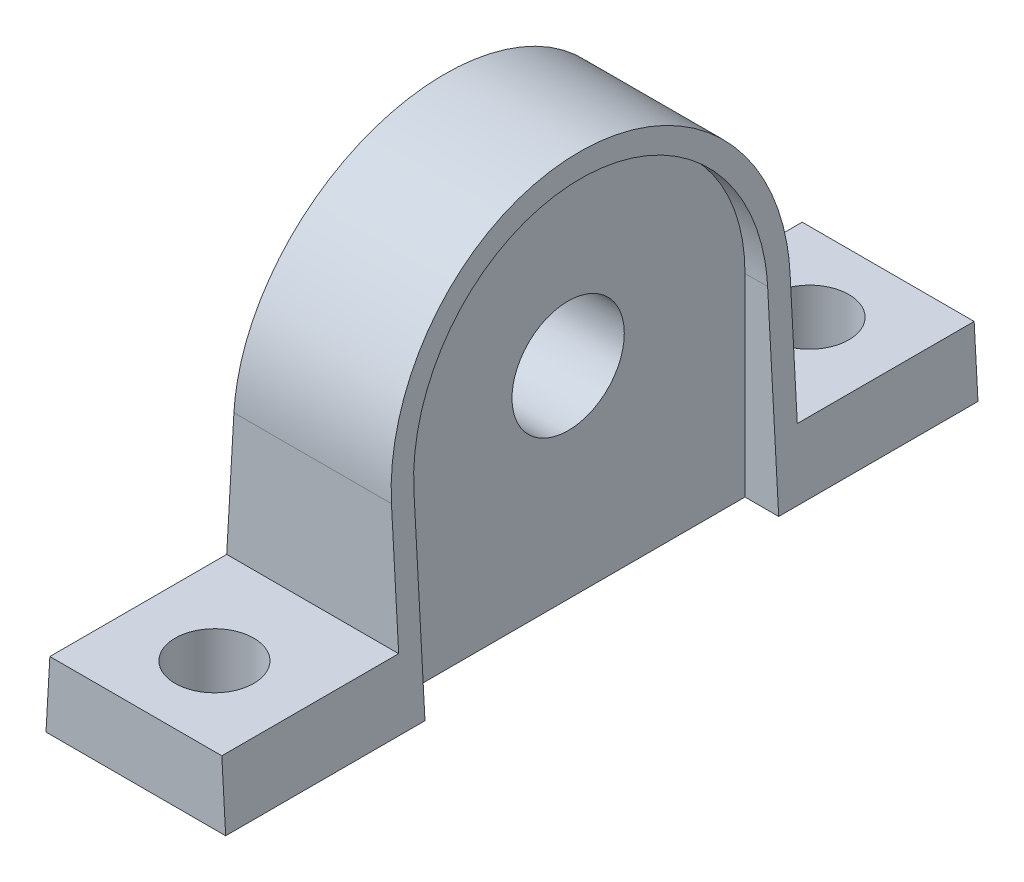
ISO-10303-21;
HEADER;
FILE_DESCRIPTION(('STEP AP214'),'2;1');
FILE_NAME('part.step','',(''),(''),'','','');
FILE_SCHEMA(('AUTOMOTIVE_DESIGN { 1 0 10303 214 1 1 1 1 }'));
ENDSEC;
DATA;
#1=APPLICATION_CONTEXT('core data for automotive mechanical design processes');
#2=APPLICATION_PROTOCOL_DEFINITION('international standard','automotive_design',2000,#1);
#3=PRODUCT_CONTEXT('',#1,'mechanical');
#4=PRODUCT('Part','Part','',(#3));
#5=PRODUCT_RELATED_PRODUCT_CATEGORY('part','',(#4));
#6=PRODUCT_DEFINITION_FORMATION('','',#4);
#7=PRODUCT_DEFINITION_CONTEXT('part definition',#1,'design');
#8=PRODUCT_DEFINITION('design','',#6,#7);
#9=PRODUCT_DEFINITION_SHAPE('','',#8);
#10=(LENGTH_UNIT() NAMED_UNIT(*) SI_UNIT(.MILLI.,.METRE.));
#11=(NAMED_UNIT(*) PLANE_ANGLE_UNIT() SI_UNIT($,.RADIAN.));
#12=(NAMED_UNIT(*) SI_UNIT($,.STERADIAN.) SOLID_ANGLE_UNIT());
#13=UNCERTAINTY_MEASURE_WITH_UNIT(LENGTH_MEASURE(1.E-05),#10,'distance_accuracy_value','');
#14=(GEOMETRIC_REPRESENTATION_CONTEXT(3) GLOBAL_UNCERTAINTY_ASSIGNED_CONTEXT((#13)) GLOBAL_UNIT_ASSIGNED_CONTEXT((#10,
#11,#12)) REPRESENTATION_CONTEXT('',''));
#15=CARTESIAN_POINT('',(0.,0.,0.));
#16=DIRECTION('',(0.,0.,1.));
#17=DIRECTION('',(1.,0.,0.));
#18=AXIS2_PLACEMENT_3D('',#15,#16,#17);
#19=CARTESIAN_POINT('',(-5.,0.,0.));
#20=DIRECTION('',(-1.,0.,0.));
#21=DIRECTION('',(0.,0.,-1.));
#22=AXIS2_PLACEMENT_3D('',#19,#20,#21);
#23=PLANE('',#22);
#24=DIRECTION('',(0.,-1.,0.));
#25=VECTOR('',#24,1.);
#26=CARTESIAN_POINT('',(-5.,0.,17.75));
#27=LINE('',#26,#25);
#28=CARTESIAN_POINT('',(-5.,17.25,17.75));
#29=VERTEX_POINT('',#28);
#30=CARTESIAN_POINT('',(-5.,0.,17.75));
#31=VERTEX_POINT('',#30);
#32=EDGE_CURVE('E191',#29,#31,#27,.T.);
#33=ORIENTED_EDGE('',*,*,#32,.T.);
#34=DIRECTION('',(0.,0.,-1.));
#35=VECTOR('',#34,1.);
#36=CARTESIAN_POINT('',(-5.,0.,0.));
#37=LINE('',#36,#35);
#38=CARTESIAN_POINT('',(-5.,0.,49.25));
#39=VERTEX_POINT('',#38);
#40=EDGE_CURVE('E202',#39,#31,#37,.T.);
#41=ORIENTED_EDGE('',*,*,#40,.F.);
#42=DIRECTION('',(0.,-1.,0.));
#43=VECTOR('',#42,1.);
#44=CARTESIAN_POINT('',(-5.,0.,49.25));
#45=LINE('',#44,#43);
#46=CARTESIAN_POINT('',(-5.,17.25,49.25));
#47=VERTEX_POINT('',#46);
#48=EDGE_CURVE('E207',#47,#39,#45,.T.);
#49=ORIENTED_EDGE('',*,*,#48,.F.);
#50=CARTESIAN_POINT('',(-5.,17.25,33.5));
#51=DIRECTION('',(1.,0.,0.));
#52=DIRECTION('',(0.,0.,-1.));
#53=AXIS2_PLACEMENT_3D('',#50,#51,#52);
#54=CIRCLE('',#53,15.75);
#55=EDGE_CURVE('E195',#29,#47,#54,.T.);
#56=ORIENTED_EDGE('',*,*,#55,.F.);
#57=EDGE_LOOP('',(#33,#41,#49,#56));
#58=FACE_BOUND('',#57,.T.);
#59=CARTESIAN_POINT('',(-5.,18.,33.5));
#60=DIRECTION('',(-1.,0.,0.));
#61=DIRECTION('',(0.,0.,1.));
#62=AXIS2_PLACEMENT_3D('',#59,#60,#61);
#63=CIRCLE('',#62,7.);
#64=CARTESIAN_POINT('',(-5.,18.,40.5));
#65=VERTEX_POINT('',#64);
#66=EDGE_CURVE('E323',#65,#65,#63,.T.);
#67=ORIENTED_EDGE('',*,*,#66,.F.);
#68=EDGE_LOOP('',(#67));
#69=FACE_BOUND('',#68,.T.);
#70=ADVANCED_FACE('F70',(#58,#69),#23,.T.);
#71=CARTESIAN_POINT('',(-15.,18.,33.5));
#72=DIRECTION('',(1.,0.,0.));
#73=DIRECTION('',(0.,0.,-1.));
#74=AXIS2_PLACEMENT_3D('',#71,#72,#73);
#75=CYLINDRICAL_SURFACE('',#74,5.);
#76=CARTESIAN_POINT('',(5.,18.,33.5));
#77=DIRECTION('',(1.,0.,0.));
#78=DIRECTION('',(0.,0.,-1.));
#79=AXIS2_PLACEMENT_3D('',#76,#77,#78);
#80=CIRCLE('',#79,5.);
#81=CARTESIAN_POINT('',(5.,18.,28.5));
#82=VERTEX_POINT('',#81);
#83=EDGE_CURVE('E229',#82,#82,#80,.F.);
#84=ORIENTED_EDGE('',*,*,#83,.F.);
#85=EDGE_LOOP('',(#84));
#86=FACE_BOUND('',#85,.T.);
#87=CARTESIAN_POINT('',(-10.,18.,33.5));
#88=DIRECTION('',(1.,0.,0.));
#89=DIRECTION('',(0.,0.,-1.));
#90=AXIS2_PLACEMENT_3D('',#87,#88,#89);
#91=CIRCLE('',#90,5.);
#92=CARTESIAN_POINT('',(-10.,18.,28.5));
#93=VERTEX_POINT('',#92);
#94=EDGE_CURVE('E318',#93,#93,#91,.T.);
#95=ORIENTED_EDGE('',*,*,#94,.F.);
#96=EDGE_LOOP('',(#95));
#97=FACE_BOUND('',#96,.T.);
#98=ADVANCED_FACE('F340',(#86,#97),#75,.F.);
#99=CARTESIAN_POINT('',(8.,0.,67.));
#100=DIRECTION('',(-0.998371334423977,-0.0570497905385129,0.));
#101=DIRECTION('',(0.0570497905385129,-0.998371334423977,0.));
#102=AXIS2_PLACEMENT_3D('',#99,#100,#101);
#103=PLANE('',#102);
#104=DIRECTION('',(-0.0570497905385129,0.998371334423977,0.));
#105=VECTOR('',#104,1.);
#106=CARTESIAN_POINT('',(8.,0.,17.75));
#107=LINE('',#106,#105);
#108=CARTESIAN_POINT('',(8.,0.,17.75));
#109=VERTEX_POINT('',#108);
#110=CARTESIAN_POINT('',(7.01428571428572,17.25,17.75));
#111=VERTEX_POINT('',#110);
#112=EDGE_CURVE('E241',#109,#111,#107,.T.);
#113=ORIENTED_EDGE('',*,*,#112,.F.);
#114=DIRECTION('',(0.,0.,-1.));
#115=VECTOR('',#114,1.);
#116=CARTESIAN_POINT('',(8.,0.,67.));
#117=LINE('',#116,#115);
#118=CARTESIAN_POINT('',(8.,0.,0.));
#119=VERTEX_POINT('',#118);
#120=EDGE_CURVE('E281',#109,#119,#117,.T.);
#121=ORIENTED_EDGE('',*,*,#120,.T.);
#122=DIRECTION('',(-0.0570497905385129,0.998371334423977,0.));
#123=VECTOR('',#122,1.);
#124=CARTESIAN_POINT('',(8.,0.,0.));
#125=LINE('',#124,#123);
#126=CARTESIAN_POINT('',(7.65714285714286,6.,0.));
#127=VERTEX_POINT('',#126);
#128=EDGE_CURVE('E272',#119,#127,#125,.T.);
#129=ORIENTED_EDGE('',*,*,#128,.T.);
#130=DIRECTION('',(0.,0.,-1.));
#131=VECTOR('',#130,1.);
#132=CARTESIAN_POINT('',(7.65714285714286,6.,67.));
#133=LINE('',#132,#131);
#134=CARTESIAN_POINT('',(7.65714285714286,6.,15.75));
#135=VERTEX_POINT('',#134);
#136=EDGE_CURVE('E266',#135,#127,#133,.T.);
#137=ORIENTED_EDGE('',*,*,#136,.F.);
#138=DIRECTION('',(0.0570497905385129,-0.998371334423977,0.));
#139=VECTOR('',#138,1.);
#140=CARTESIAN_POINT('',(8.,0.,15.75));
#141=LINE('',#140,#139);
#142=CARTESIAN_POINT('',(7.01428571428572,17.25,15.75));
#143=VERTEX_POINT('',#142);
#144=EDGE_CURVE('E270',#143,#135,#141,.T.);
#145=ORIENTED_EDGE('',*,*,#144,.F.);
#146=CARTESIAN_POINT('',(7.01428571428572,17.25,33.5));
#147=DIRECTION('',(-0.998371334423977,-0.0570497905385129,0.));
#148=DIRECTION('',(0.057049790538513,-0.998371334423977,0.));
#149=AXIS2_PLACEMENT_3D('',#146,#147,#148);
#150=ELLIPSE('',#149,17.7789559735718,17.75);
#151=CARTESIAN_POINT('',(7.01428571428572,17.25,51.25));
#152=VERTEX_POINT('',#151);
#153=EDGE_CURVE('E268',#143,#152,#150,.F.);
#154=ORIENTED_EDGE('',*,*,#153,.T.);
#155=DIRECTION('',(0.0570497905385129,-0.998371334423977,0.));
#156=VECTOR('',#155,1.);
#157=CARTESIAN_POINT('',(8.,0.,51.25));
#158=LINE('',#157,#156);
#159=CARTESIAN_POINT('',(7.65714285714286,6.,51.25));
#160=VERTEX_POINT('',#159);
#161=EDGE_CURVE('E255',#152,#160,#158,.T.);
#162=ORIENTED_EDGE('',*,*,#161,.T.);
#163=DIRECTION('',(0.,0.,1.));
#164=VECTOR('',#163,1.);
#165=CARTESIAN_POINT('',(7.65714285714286,6.,67.));
#166=LINE('',#165,#164);
#167=CARTESIAN_POINT('',(7.65714285714286,6.,67.));
#168=VERTEX_POINT('',#167);
#169=EDGE_CURVE('E252',#160,#168,#166,.T.);
#170=ORIENTED_EDGE('',*,*,#169,.T.);
#171=DIRECTION('',(-0.0570497905385129,0.998371334423977,0.));
#172=VECTOR('',#171,1.);
#173=CARTESIAN_POINT('',(8.,0.,67.));
#174=LINE('',#173,#172);
#175=CARTESIAN_POINT('',(8.,0.,67.));
#176=VERTEX_POINT('',#175);
#177=EDGE_CURVE('E273',#176,#168,#174,.T.);
#178=ORIENTED_EDGE('',*,*,#177,.F.);
#179=CARTESIAN_POINT('',(8.,0.,49.25));
#180=VERTEX_POINT('',#179);
#181=EDGE_CURVE('E289',#176,#180,#117,.T.);
#182=ORIENTED_EDGE('',*,*,#181,.T.);
#183=DIRECTION('',(-0.0570497905385129,0.998371334423977,0.));
#184=VECTOR('',#183,1.);
#185=CARTESIAN_POINT('',(8.,0.,49.25));
#186=LINE('',#185,#184);
#187=CARTESIAN_POINT('',(7.01428571428572,17.25,49.25));
#188=VERTEX_POINT('',#187);
#189=EDGE_CURVE('E238',#180,#188,#186,.T.);
#190=ORIENTED_EDGE('',*,*,#189,.T.);
#191=CARTESIAN_POINT('',(7.01428571428572,17.25,33.5));
#192=DIRECTION('',(-0.998371334423977,-0.0570497905385129,0.));
#193=DIRECTION('',(0.057049790538513,-0.998371334423977,0.));
#194=AXIS2_PLACEMENT_3D('',#191,#192,#193);
#195=ELLIPSE('',#194,15.7756933286623,15.75);
#196=EDGE_CURVE('E309',#188,#111,#195,.T.);
#197=ORIENTED_EDGE('',*,*,#196,.T.);
#198=EDGE_LOOP('',(#113,#121,#129,#137,#145,#154,#162,#170,#178,#182,#190,#197));
#199=FACE_BOUND('',#198,.T.);
#200=ADVANCED_FACE('F72',(#199),#103,.F.);
#201=CARTESIAN_POINT('',(8.,0.,67.));
#202=DIRECTION('',(0.,1.,0.));
#203=DIRECTION('',(0.,0.,1.));
#204=AXIS2_PLACEMENT_3D('',#201,#202,#203);
#205=PLANE('',#204);
#206=CARTESIAN_POINT('',(0.,0.,7.00000000000001));
#207=DIRECTION('',(0.,-1.,0.));
#208=DIRECTION('',(0.,0.,1.));
#209=AXIS2_PLACEMENT_3D('',#206,#207,#208);
#210=CIRCLE('',#209,3.5);
#211=CARTESIAN_POINT('',(0.,0.,10.5));
#212=VERTEX_POINT('',#211);
#213=EDGE_CURVE('E330',#212,#212,#210,.T.);
#214=ORIENTED_EDGE('',*,*,#213,.F.);
#215=EDGE_LOOP('',(#214));
#216=FACE_BOUND('',#215,.T.);
#217=CARTESIAN_POINT('',(0.,0.,60.));
#218=DIRECTION('',(0.,-1.,0.));
#219=DIRECTION('',(0.,0.,-1.));
#220=AXIS2_PLACEMENT_3D('',#217,#218,#219);
#221=CIRCLE('',#220,3.5);
#222=CARTESIAN_POINT('',(0.,0.,56.5));
#223=VERTEX_POINT('',#222);
#224=EDGE_CURVE('E319',#223,#223,#221,.T.);
#225=ORIENTED_EDGE('',*,*,#224,.F.);
#226=EDGE_LOOP('',(#225));
#227=FACE_BOUND('',#226,.T.);
#228=ORIENTED_EDGE('',*,*,#40,.T.);
#229=DIRECTION('',(-1.,0.,0.));
#230=VECTOR('',#229,1.);
#231=CARTESIAN_POINT('',(-5.,0.,17.75));
#232=LINE('',#231,#230);
#233=CARTESIAN_POINT('',(-8.,0.,17.75));
#234=VERTEX_POINT('',#233);
#235=EDGE_CURVE('E187',#31,#234,#232,.T.);
#236=ORIENTED_EDGE('',*,*,#235,.T.);
#237=DIRECTION('',(0.,0.,-1.));
#238=VECTOR('',#237,1.);
#239=CARTESIAN_POINT('',(-8.,0.,67.));
#240=LINE('',#239,#238);
#241=CARTESIAN_POINT('',(-8.,0.,0.));
#242=VERTEX_POINT('',#241);
#243=EDGE_CURVE('E292',#234,#242,#240,.T.);
#244=ORIENTED_EDGE('',*,*,#243,.T.);
#245=DIRECTION('',(1.,0.,0.));
#246=VECTOR('',#245,1.);
#247=CARTESIAN_POINT('',(8.,0.,0.));
#248=LINE('',#247,#246);
#249=EDGE_CURVE('E277',#242,#119,#248,.T.);
#250=ORIENTED_EDGE('',*,*,#249,.T.);
#251=ORIENTED_EDGE('',*,*,#120,.F.);
#252=DIRECTION('',(1.,0.,0.));
#253=VECTOR('',#252,1.);
#254=CARTESIAN_POINT('',(5.,0.,17.75));
#255=LINE('',#254,#253);
#256=CARTESIAN_POINT('',(5.,0.,17.75));
#257=VERTEX_POINT('',#256);
#258=EDGE_CURVE('E227',#257,#109,#255,.T.);
#259=ORIENTED_EDGE('',*,*,#258,.F.);
#260=DIRECTION('',(0.,0.,-1.));
#261=VECTOR('',#260,1.);
#262=CARTESIAN_POINT('',(5.,0.,0.));
#263=LINE('',#262,#261);
#264=CARTESIAN_POINT('',(5.,0.,49.25));
#265=VERTEX_POINT('',#264);
#266=EDGE_CURVE('E224',#265,#257,#263,.T.);
#267=ORIENTED_EDGE('',*,*,#266,.F.);
#268=DIRECTION('',(1.,0.,0.));
#269=VECTOR('',#268,1.);
#270=CARTESIAN_POINT('',(5.,0.,49.25));
#271=LINE('',#270,#269);
#272=EDGE_CURVE('E230',#265,#180,#271,.T.);
#273=ORIENTED_EDGE('',*,*,#272,.T.);
#274=ORIENTED_EDGE('',*,*,#181,.F.);
#275=DIRECTION('',(1.,0.,0.));
#276=VECTOR('',#275,1.);
#277=CARTESIAN_POINT('',(8.,0.,67.));
#278=LINE('',#277,#276);
#279=CARTESIAN_POINT('',(-8.,0.,67.));
#280=VERTEX_POINT('',#279);
#281=EDGE_CURVE('E279',#280,#176,#278,.T.);
#282=ORIENTED_EDGE('',*,*,#281,.F.);
#283=CARTESIAN_POINT('',(-8.,0.,49.25));
#284=VERTEX_POINT('',#283);
#285=EDGE_CURVE('E293',#280,#284,#240,.T.);
#286=ORIENTED_EDGE('',*,*,#285,.T.);
#287=DIRECTION('',(-1.,0.,0.));
#288=VECTOR('',#287,1.);
#289=CARTESIAN_POINT('',(-5.,0.,49.25));
#290=LINE('',#289,#288);
#291=EDGE_CURVE('E87',#39,#284,#290,.T.);
#292=ORIENTED_EDGE('',*,*,#291,.F.);
#293=EDGE_LOOP('',(#228,#236,#244,#250,#251,#259,#267,#273,#274,#282,#286,#292));
#294=FACE_BOUND('',#293,.T.);
#295=ADVANCED_FACE('F205',(#216,#227,#294),#205,.F.);
#296=CARTESIAN_POINT('',(-8.,0.,67.));
#297=DIRECTION('',(0.998371334423977,-0.0570497905385129,0.));
#298=DIRECTION('',(0.0570497905385129,0.998371334423977,0.));
#299=AXIS2_PLACEMENT_3D('',#296,#297,#298);
#300=PLANE('',#299);
#301=ORIENTED_EDGE('',*,*,#243,.F.);
#302=DIRECTION('',(0.0570497905385129,0.998371334423977,0.));
#303=VECTOR('',#302,1.);
#304=CARTESIAN_POINT('',(-8.,0.,17.75));
#305=LINE('',#304,#303);
#306=CARTESIAN_POINT('',(-7.01428571428572,17.25,17.75));
#307=VERTEX_POINT('',#306);
#308=EDGE_CURVE('E12',#234,#307,#305,.T.);
#309=ORIENTED_EDGE('',*,*,#308,.T.);
#310=CARTESIAN_POINT('',(-7.01428571428572,17.25,33.5));
#311=DIRECTION('',(0.998371334423977,-0.0570497905385129,0.));
#312=DIRECTION('',(-0.057049790538513,-0.998371334423977,0.));
#313=AXIS2_PLACEMENT_3D('',#310,#311,#312);
#314=ELLIPSE('',#313,15.7756933286623,15.75);
#315=CARTESIAN_POINT('',(-7.01428571428571,17.25,49.25));
#316=VERTEX_POINT('',#315);
#317=EDGE_CURVE('E79',#316,#307,#314,.F.);
#318=ORIENTED_EDGE('',*,*,#317,.F.);
#319=DIRECTION('',(0.0570497905385129,0.998371334423977,0.));
#320=VECTOR('',#319,1.);
#321=CARTESIAN_POINT('',(-8.,0.,49.25));
#322=LINE('',#321,#320);
#323=EDGE_CURVE('E314',#284,#316,#322,.T.);
#324=ORIENTED_EDGE('',*,*,#323,.F.);
#325=ORIENTED_EDGE('',*,*,#285,.F.);
#326=DIRECTION('',(-0.0570497905385129,-0.998371334423977,0.));
#327=VECTOR('',#326,1.);
#328=CARTESIAN_POINT('',(-8.,0.,67.));
#329=LINE('',#328,#327);
#330=CARTESIAN_POINT('',(-7.65714285714286,6.,67.));
#331=VERTEX_POINT('',#330);
#332=EDGE_CURVE('E276',#331,#280,#329,.T.);
#333=ORIENTED_EDGE('',*,*,#332,.F.);
#334=DIRECTION('',(0.,0.,-1.));
#335=VECTOR('',#334,1.);
#336=CARTESIAN_POINT('',(-7.65714285714286,6.,67.));
#337=LINE('',#336,#335);
#338=CARTESIAN_POINT('',(-7.65714285714286,6.,51.25));
#339=VERTEX_POINT('',#338);
#340=EDGE_CURVE('E247',#331,#339,#337,.T.);
#341=ORIENTED_EDGE('',*,*,#340,.T.);
#342=DIRECTION('',(0.0570497905385129,0.998371334423977,0.));
#343=VECTOR('',#342,1.);
#344=CARTESIAN_POINT('',(-8.,0.,51.25));
#345=LINE('',#344,#343);
#346=CARTESIAN_POINT('',(-7.01428571428572,17.25,51.25));
#347=VERTEX_POINT('',#346);
#348=EDGE_CURVE('E306',#339,#347,#345,.T.);
#349=ORIENTED_EDGE('',*,*,#348,.T.);
#350=CARTESIAN_POINT('',(-7.01428571428572,17.25,33.5));
#351=DIRECTION('',(0.998371334423977,-0.0570497905385129,0.));
#352=DIRECTION('',(0.057049790538513,0.998371334423977,0.));
#353=AXIS2_PLACEMENT_3D('',#350,#351,#352);
#354=ELLIPSE('',#353,17.7789559735718,17.75);
#355=CARTESIAN_POINT('',(-7.01428571428572,17.25,15.75));
#356=VERTEX_POINT('',#355);
#357=EDGE_CURVE('E298',#347,#356,#354,.F.);
#358=ORIENTED_EDGE('',*,*,#357,.T.);
#359=DIRECTION('',(0.0570497905385129,0.998371334423977,0.));
#360=VECTOR('',#359,1.);
#361=CARTESIAN_POINT('',(-8.,0.,15.75));
#362=LINE('',#361,#360);
#363=CARTESIAN_POINT('',(-7.65714285714286,6.,15.75));
#364=VERTEX_POINT('',#363);
#365=EDGE_CURVE('E301',#364,#356,#362,.T.);
#366=ORIENTED_EDGE('',*,*,#365,.F.);
#367=DIRECTION('',(0.,0.,1.));
#368=VECTOR('',#367,1.);
#369=CARTESIAN_POINT('',(-7.65714285714286,6.,67.));
#370=LINE('',#369,#368);
#371=CARTESIAN_POINT('',(-7.65714285714286,6.,0.));
#372=VERTEX_POINT('',#371);
#373=EDGE_CURVE('E262',#372,#364,#370,.T.);
#374=ORIENTED_EDGE('',*,*,#373,.F.);
#375=DIRECTION('',(-0.0570497905385129,-0.998371334423977,0.));
#376=VECTOR('',#375,1.);
#377=CARTESIAN_POINT('',(-8.,0.,0.));
#378=LINE('',#377,#376);
#379=EDGE_CURVE('E284',#372,#242,#378,.T.);
#380=ORIENTED_EDGE('',*,*,#379,.T.);
#381=EDGE_LOOP('',(#301,#309,#318,#324,#325,#333,#341,#349,#358,#366,#374,#380));
#382=FACE_BOUND('',#381,.T.);
#383=ADVANCED_FACE('F401',(#382),#300,.F.);
#384=CARTESIAN_POINT('',(0.,0.,0.));
#385=DIRECTION('',(0.,0.,-1.));
#386=DIRECTION('',(-1.,0.,0.));
#387=AXIS2_PLACEMENT_3D('',#384,#385,#386);
#388=PLANE('',#387);
#389=ORIENTED_EDGE('',*,*,#379,.F.);
#390=DIRECTION('',(1.,0.,0.));
#391=VECTOR('',#390,1.);
#392=CARTESIAN_POINT('',(0.,6.,0.));
#393=LINE('',#392,#391);
#394=EDGE_CURVE('E295',#372,#127,#393,.T.);
#395=ORIENTED_EDGE('',*,*,#394,.T.);
#396=ORIENTED_EDGE('',*,*,#128,.F.);
#397=ORIENTED_EDGE('',*,*,#249,.F.);
#398=EDGE_LOOP('',(#389,#395,#396,#397));
#399=FACE_BOUND('',#398,.T.);
#400=ADVANCED_FACE('F397',(#399),#388,.T.);
#401=CARTESIAN_POINT('',(0.,0.,67.));
#402=DIRECTION('',(0.,0.,-1.));
#403=DIRECTION('',(-1.,0.,0.));
#404=AXIS2_PLACEMENT_3D('',#401,#402,#403);
#405=PLANE('',#404);
#406=ORIENTED_EDGE('',*,*,#177,.T.);
#407=DIRECTION('',(-1.,0.,0.));
#408=VECTOR('',#407,1.);
#409=CARTESIAN_POINT('',(0.,6.,67.));
#410=LINE('',#409,#408);
#411=EDGE_CURVE('E303',#168,#331,#410,.T.);
#412=ORIENTED_EDGE('',*,*,#411,.T.);
#413=ORIENTED_EDGE('',*,*,#332,.T.);
#414=ORIENTED_EDGE('',*,*,#281,.T.);
#415=EDGE_LOOP('',(#406,#412,#413,#414));
#416=FACE_BOUND('',#415,.T.);
#417=ADVANCED_FACE('F390',(#416),#405,.F.);
#418=CARTESIAN_POINT('',(-15.,0.,15.75));
#419=DIRECTION('',(0.,0.,-1.));
#420=DIRECTION('',(-1.,0.,0.));
#421=AXIS2_PLACEMENT_3D('',#418,#419,#420);
#422=PLANE('',#421);
#423=ORIENTED_EDGE('',*,*,#144,.T.);
#424=DIRECTION('',(1.,0.,0.));
#425=VECTOR('',#424,1.);
#426=CARTESIAN_POINT('',(-15.,6.,15.75));
#427=LINE('',#426,#425);
#428=EDGE_CURVE('E259',#364,#135,#427,.T.);
#429=ORIENTED_EDGE('',*,*,#428,.F.);
#430=ORIENTED_EDGE('',*,*,#365,.T.);
#431=DIRECTION('',(1.,0.,0.));
#432=VECTOR('',#431,1.);
#433=CARTESIAN_POINT('',(-15.,17.25,15.75));
#434=LINE('',#433,#432);
#435=EDGE_CURVE('E258',#356,#143,#434,.T.);
#436=ORIENTED_EDGE('',*,*,#435,.T.);
#437=EDGE_LOOP('',(#423,#429,#430,#436));
#438=FACE_BOUND('',#437,.T.);
#439=ADVANCED_FACE('F387',(#438),#422,.T.);
#440=CARTESIAN_POINT('',(-15.,17.25,33.5));
#441=DIRECTION('',(1.,0.,0.));
#442=DIRECTION('',(0.,0.,-1.));
#443=AXIS2_PLACEMENT_3D('',#440,#441,#442);
#444=CYLINDRICAL_SURFACE('',#443,17.75);
#445=ORIENTED_EDGE('',*,*,#435,.F.);
#446=ORIENTED_EDGE('',*,*,#357,.F.);
#447=DIRECTION('',(1.,0.,0.));
#448=VECTOR('',#447,1.);
#449=CARTESIAN_POINT('',(-15.,17.25,51.25));
#450=LINE('',#449,#448);
#451=EDGE_CURVE('E243',#347,#152,#450,.T.);
#452=ORIENTED_EDGE('',*,*,#451,.T.);
#453=ORIENTED_EDGE('',*,*,#153,.F.);
#454=EDGE_LOOP('',(#445,#446,#452,#453));
#455=FACE_BOUND('',#454,.T.);
#456=ADVANCED_FACE('F385',(#455),#444,.T.);
#457=CARTESIAN_POINT('',(-15.,6.,0.));
#458=DIRECTION('',(0.,1.,0.));
#459=DIRECTION('',(0.,0.,1.));
#460=AXIS2_PLACEMENT_3D('',#457,#458,#459);
#461=PLANE('',#460);
#462=CARTESIAN_POINT('',(0.,6.,7.00000000000001));
#463=DIRECTION('',(0.,1.,0.));
#464=DIRECTION('',(0.,0.,1.));
#465=AXIS2_PLACEMENT_3D('',#462,#463,#464);
#466=CIRCLE('',#465,3.5);
#467=CARTESIAN_POINT('',(0.,6.,10.5));
#468=VERTEX_POINT('',#467);
#469=EDGE_CURVE('E74',#468,#468,#466,.T.);
#470=ORIENTED_EDGE('',*,*,#469,.F.);
#471=EDGE_LOOP('',(#470));
#472=FACE_BOUND('',#471,.T.);
#473=ORIENTED_EDGE('',*,*,#136,.T.);
#474=ORIENTED_EDGE('',*,*,#394,.F.);
#475=ORIENTED_EDGE('',*,*,#373,.T.);
#476=ORIENTED_EDGE('',*,*,#428,.T.);
#477=EDGE_LOOP('',(#473,#474,#475,#476));
#478=FACE_BOUND('',#477,.T.);
#479=ADVANCED_FACE('F381',(#472,#478),#461,.T.);
#480=CARTESIAN_POINT('',(-15.,0.,51.25));
#481=DIRECTION('',(0.,0.,-1.));
#482=DIRECTION('',(-1.,0.,0.));
#483=AXIS2_PLACEMENT_3D('',#480,#481,#482);
#484=PLANE('',#483);
#485=ORIENTED_EDGE('',*,*,#451,.F.);
#486=ORIENTED_EDGE('',*,*,#348,.F.);
#487=DIRECTION('',(1.,0.,0.));
#488=VECTOR('',#487,1.);
#489=CARTESIAN_POINT('',(-15.,6.,51.25));
#490=LINE('',#489,#488);
#491=EDGE_CURVE('E244',#339,#160,#490,.T.);
#492=ORIENTED_EDGE('',*,*,#491,.T.);
#493=ORIENTED_EDGE('',*,*,#161,.F.);
#494=EDGE_LOOP('',(#485,#486,#492,#493));
#495=FACE_BOUND('',#494,.T.);
#496=ADVANCED_FACE('F378',(#495),#484,.F.);
#497=CARTESIAN_POINT('',(-15.,6.,0.));
#498=DIRECTION('',(0.,-1.,0.));
#499=DIRECTION('',(0.,0.,-1.));
#500=AXIS2_PLACEMENT_3D('',#497,#498,#499);
#501=PLANE('',#500);
#502=CARTESIAN_POINT('',(0.,6.,60.));
#503=DIRECTION('',(0.,-1.,0.));
#504=DIRECTION('',(0.,0.,-1.));
#505=AXIS2_PLACEMENT_3D('',#502,#503,#504);
#506=CIRCLE('',#505,3.5);
#507=CARTESIAN_POINT('',(0.,6.,56.5));
#508=VERTEX_POINT('',#507);
#509=EDGE_CURVE('E316',#508,#508,#506,.T.);
#510=ORIENTED_EDGE('',*,*,#509,.T.);
#511=EDGE_LOOP('',(#510));
#512=FACE_BOUND('',#511,.T.);
#513=ORIENTED_EDGE('',*,*,#491,.F.);
#514=ORIENTED_EDGE('',*,*,#340,.F.);
#515=ORIENTED_EDGE('',*,*,#411,.F.);
#516=ORIENTED_EDGE('',*,*,#169,.F.);
#517=EDGE_LOOP('',(#513,#514,#515,#516));
#518=FACE_BOUND('',#517,.T.);
#519=ADVANCED_FACE('F371',(#512,#518),#501,.F.);
#520=CARTESIAN_POINT('',(5.,17.25,33.5));
#521=DIRECTION('',(1.,0.,0.));
#522=DIRECTION('',(0.,0.,-1.));
#523=AXIS2_PLACEMENT_3D('',#520,#521,#522);
#524=CYLINDRICAL_SURFACE('',#523,15.75);
#525=DIRECTION('',(1.,0.,0.));
#526=VECTOR('',#525,1.);
#527=CARTESIAN_POINT('',(5.,17.25,49.25));
#528=LINE('',#527,#526);
#529=CARTESIAN_POINT('',(5.,17.25,49.25));
#530=VERTEX_POINT('',#529);
#531=EDGE_CURVE('E233',#530,#188,#528,.T.);
#532=ORIENTED_EDGE('',*,*,#531,.F.);
#533=CARTESIAN_POINT('',(5.,17.25,33.5));
#534=DIRECTION('',(1.,0.,0.));
#535=DIRECTION('',(0.,0.,-1.));
#536=AXIS2_PLACEMENT_3D('',#533,#534,#535);
#537=CIRCLE('',#536,15.75);
#538=CARTESIAN_POINT('',(5.,17.25,17.75));
#539=VERTEX_POINT('',#538);
#540=EDGE_CURVE('E221',#539,#530,#537,.T.);
#541=ORIENTED_EDGE('',*,*,#540,.F.);
#542=DIRECTION('',(1.,0.,0.));
#543=VECTOR('',#542,1.);
#544=CARTESIAN_POINT('',(5.,17.25,17.75));
#545=LINE('',#544,#543);
#546=EDGE_CURVE('E226',#539,#111,#545,.T.);
#547=ORIENTED_EDGE('',*,*,#546,.T.);
#548=ORIENTED_EDGE('',*,*,#196,.F.);
#549=EDGE_LOOP('',(#532,#541,#547,#548));
#550=FACE_BOUND('',#549,.T.);
#551=ADVANCED_FACE('F368',(#550),#524,.F.);
#552=CARTESIAN_POINT('',(5.,0.,17.75));
#553=DIRECTION('',(0.,0.,1.));
#554=DIRECTION('',(1.,0.,0.));
#555=AXIS2_PLACEMENT_3D('',#552,#553,#554);
#556=PLANE('',#555);
#557=ORIENTED_EDGE('',*,*,#112,.T.);
#558=ORIENTED_EDGE('',*,*,#546,.F.);
#559=DIRECTION('',(0.,-1.,0.));
#560=VECTOR('',#559,1.);
#561=CARTESIAN_POINT('',(5.,0.,17.75));
#562=LINE('',#561,#560);
#563=EDGE_CURVE('E215',#539,#257,#562,.T.);
#564=ORIENTED_EDGE('',*,*,#563,.T.);
#565=ORIENTED_EDGE('',*,*,#258,.T.);
#566=EDGE_LOOP('',(#557,#558,#564,#565));
#567=FACE_BOUND('',#566,.T.);
#568=ADVANCED_FACE('F366',(#567),#556,.T.);
#569=CARTESIAN_POINT('',(5.,0.,49.25));
#570=DIRECTION('',(0.,0.,1.));
#571=DIRECTION('',(1.,0.,0.));
#572=AXIS2_PLACEMENT_3D('',#569,#570,#571);
#573=PLANE('',#572);
#574=ORIENTED_EDGE('',*,*,#272,.F.);
#575=DIRECTION('',(0.,-1.,0.));
#576=VECTOR('',#575,1.);
#577=CARTESIAN_POINT('',(5.,0.,49.25));
#578=LINE('',#577,#576);
#579=EDGE_CURVE('E95',#530,#265,#578,.T.);
#580=ORIENTED_EDGE('',*,*,#579,.F.);
#581=ORIENTED_EDGE('',*,*,#531,.T.);
#582=ORIENTED_EDGE('',*,*,#189,.F.);
#583=EDGE_LOOP('',(#574,#580,#581,#582));
#584=FACE_BOUND('',#583,.T.);
#585=ADVANCED_FACE('F363',(#584),#573,.F.);
#586=CARTESIAN_POINT('',(5.,0.,0.));
#587=DIRECTION('',(1.,0.,0.));
#588=DIRECTION('',(0.,0.,-1.));
#589=AXIS2_PLACEMENT_3D('',#586,#587,#588);
#590=PLANE('',#589);
#591=ORIENTED_EDGE('',*,*,#563,.F.);
#592=ORIENTED_EDGE('',*,*,#540,.T.);
#593=ORIENTED_EDGE('',*,*,#579,.T.);
#594=ORIENTED_EDGE('',*,*,#266,.T.);
#595=EDGE_LOOP('',(#591,#592,#593,#594));
#596=FACE_BOUND('',#595,.T.);
#597=ORIENTED_EDGE('',*,*,#83,.T.);
#598=EDGE_LOOP('',(#597));
#599=FACE_BOUND('',#598,.T.);
#600=ADVANCED_FACE('F360',(#596,#599),#590,.T.);
#601=CARTESIAN_POINT('',(-5.,0.,17.75));
#602=DIRECTION('',(0.,0.,-1.));
#603=DIRECTION('',(-1.,0.,0.));
#604=AXIS2_PLACEMENT_3D('',#601,#602,#603);
#605=PLANE('',#604);
#606=ORIENTED_EDGE('',*,*,#235,.F.);
#607=ORIENTED_EDGE('',*,*,#32,.F.);
#608=DIRECTION('',(-1.,0.,0.));
#609=VECTOR('',#608,1.);
#610=CARTESIAN_POINT('',(-5.,17.25,17.75));
#611=LINE('',#610,#609);
#612=EDGE_CURVE('E213',#29,#307,#611,.T.);
#613=ORIENTED_EDGE('',*,*,#612,.T.);
#614=ORIENTED_EDGE('',*,*,#308,.F.);
#615=EDGE_LOOP('',(#606,#607,#613,#614));
#616=FACE_BOUND('',#615,.T.);
#617=ADVANCED_FACE('F189',(#616),#605,.F.);
#618=CARTESIAN_POINT('',(-5.,17.25,33.5));
#619=DIRECTION('',(-1.,0.,0.));
#620=DIRECTION('',(0.,0.,1.));
#621=AXIS2_PLACEMENT_3D('',#618,#619,#620);
#622=CYLINDRICAL_SURFACE('',#621,15.75);
#623=ORIENTED_EDGE('',*,*,#317,.T.);
#624=ORIENTED_EDGE('',*,*,#612,.F.);
#625=ORIENTED_EDGE('',*,*,#55,.T.);
#626=DIRECTION('',(-1.,0.,0.));
#627=VECTOR('',#626,1.);
#628=CARTESIAN_POINT('',(-5.,17.25,49.25));
#629=LINE('',#628,#627);
#630=EDGE_CURVE('E216',#47,#316,#629,.T.);
#631=ORIENTED_EDGE('',*,*,#630,.T.);
#632=EDGE_LOOP('',(#623,#624,#625,#631));
#633=FACE_BOUND('',#632,.T.);
#634=ADVANCED_FACE('F350',(#633),#622,.F.);
#635=CARTESIAN_POINT('',(-5.,0.,49.25));
#636=DIRECTION('',(0.,0.,-1.));
#637=DIRECTION('',(-1.,0.,0.));
#638=AXIS2_PLACEMENT_3D('',#635,#636,#637);
#639=PLANE('',#638);
#640=ORIENTED_EDGE('',*,*,#323,.T.);
#641=ORIENTED_EDGE('',*,*,#630,.F.);
#642=ORIENTED_EDGE('',*,*,#48,.T.);
#643=ORIENTED_EDGE('',*,*,#291,.T.);
#644=EDGE_LOOP('',(#640,#641,#642,#643));
#645=FACE_BOUND('',#644,.T.);
#646=ADVANCED_FACE('F353',(#645),#639,.T.);
#647=CARTESIAN_POINT('',(-10.,18.,33.5));
#648=DIRECTION('',(1.,0.,0.));
#649=DIRECTION('',(0.,0.,-1.));
#650=AXIS2_PLACEMENT_3D('',#647,#648,#649);
#651=PLANE('',#650);
#652=CARTESIAN_POINT('',(-10.,18.,33.5));
#653=DIRECTION('',(1.,0.,0.));
#654=DIRECTION('',(0.,0.,-1.));
#655=AXIS2_PLACEMENT_3D('',#652,#653,#654);
#656=CIRCLE('',#655,7.);
#657=CARTESIAN_POINT('',(-10.,18.,26.5));
#658=VERTEX_POINT('',#657);
#659=EDGE_CURVE('E203',#658,#658,#656,.T.);
#660=ORIENTED_EDGE('',*,*,#659,.F.);
#661=EDGE_LOOP('',(#660));
#662=FACE_BOUND('',#661,.T.);
#663=ORIENTED_EDGE('',*,*,#94,.T.);
#664=EDGE_LOOP('',(#663));
#665=FACE_BOUND('',#664,.T.);
#666=ADVANCED_FACE('F357',(#662,#665),#651,.F.);
#667=CARTESIAN_POINT('',(14.7989898732233,18.,33.5));
#668=DIRECTION('',(-1.,0.,0.));
#669=DIRECTION('',(0.,0.,1.));
#670=AXIS2_PLACEMENT_3D('',#667,#668,#669);
#671=CYLINDRICAL_SURFACE('',#670,7.);
#672=ORIENTED_EDGE('',*,*,#66,.T.);
#673=EDGE_LOOP('',(#672));
#674=FACE_BOUND('',#673,.T.);
#675=ORIENTED_EDGE('',*,*,#659,.T.);
#676=EDGE_LOOP('',(#675));
#677=FACE_BOUND('',#676,.T.);
#678=ADVANCED_FACE('F337',(#674,#677),#671,.T.);
#679=CARTESIAN_POINT('',(0.,10.,60.));
#680=DIRECTION('',(0.,-1.,0.));
#681=DIRECTION('',(0.,0.,-1.));
#682=AXIS2_PLACEMENT_3D('',#679,#680,#681);
#683=CYLINDRICAL_SURFACE('',#682,3.5);
#684=ORIENTED_EDGE('',*,*,#224,.T.);
#685=EDGE_LOOP('',(#684));
#686=FACE_BOUND('',#685,.T.);
#687=ORIENTED_EDGE('',*,*,#509,.F.);
#688=EDGE_LOOP('',(#687));
#689=FACE_BOUND('',#688,.T.);
#690=ADVANCED_FACE('F447',(#686,#689),#683,.F.);
#691=CARTESIAN_POINT('',(0.,10.,7.00000000000001));
#692=DIRECTION('',(0.,-1.,0.));
#693=DIRECTION('',(0.,0.,-1.));
#694=AXIS2_PLACEMENT_3D('',#691,#692,#693);
#695=CYLINDRICAL_SURFACE('',#694,3.5);
#696=ORIENTED_EDGE('',*,*,#469,.T.);
#697=EDGE_LOOP('',(#696));
#698=FACE_BOUND('',#697,.T.);
#699=ORIENTED_EDGE('',*,*,#213,.T.);
#700=EDGE_LOOP('',(#699));
#701=FACE_BOUND('',#700,.T.);
#702=ADVANCED_FACE('F452',(#698,#701),#695,.F.);
#703=CLOSED_SHELL('',(#70,#98,#200,#295,#383,#400,#417,#439,#456,#479,#496,#519,#551,#568,#585,
#600,#617,#634,#646,#666,#678,#690,#702));
#704=MANIFOLD_SOLID_BREP('B2',#703);
#705=ADVANCED_BREP_SHAPE_REPRESENTATION('',(#18,#704),#14);
#706=SHAPE_DEFINITION_REPRESENTATION(#9,#705);
ENDSEC;
END-ISO-10303-21;
